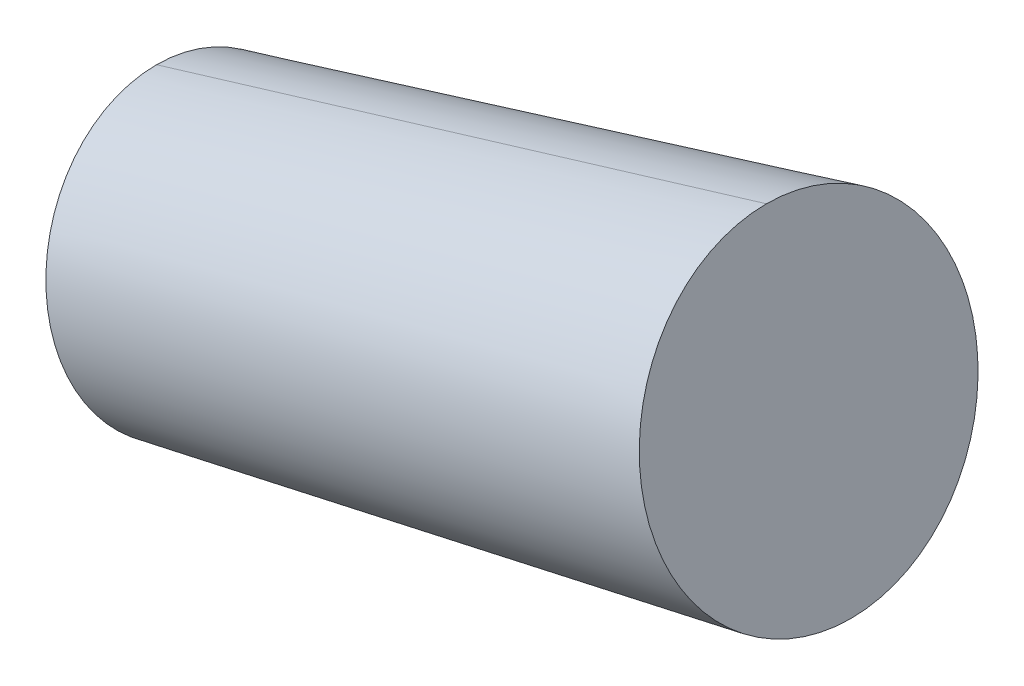
ISO-10303-21;
HEADER;
FILE_DESCRIPTION(('STEP AP214'),'2;1');
FILE_NAME('part.step','',(''),(''),'','','');
FILE_SCHEMA(('AUTOMOTIVE_DESIGN { 1 0 10303 214 1 1 1 1 }'));
ENDSEC;
DATA;
#1=APPLICATION_CONTEXT('core data for automotive mechanical design processes');
#2=APPLICATION_PROTOCOL_DEFINITION('international standard','automotive_design',2000,#1);
#3=PRODUCT_CONTEXT('',#1,'mechanical');
#4=PRODUCT('Part','Part','',(#3));
#5=PRODUCT_RELATED_PRODUCT_CATEGORY('part','',(#4));
#6=PRODUCT_DEFINITION_FORMATION('','',#4);
#7=PRODUCT_DEFINITION_CONTEXT('part definition',#1,'design');
#8=PRODUCT_DEFINITION('design','',#6,#7);
#9=PRODUCT_DEFINITION_SHAPE('','',#8);
#10=(LENGTH_UNIT() NAMED_UNIT(*) SI_UNIT(.MILLI.,.METRE.));
#11=(NAMED_UNIT(*) PLANE_ANGLE_UNIT() SI_UNIT($,.RADIAN.));
#12=(NAMED_UNIT(*) SI_UNIT($,.STERADIAN.) SOLID_ANGLE_UNIT());
#13=UNCERTAINTY_MEASURE_WITH_UNIT(LENGTH_MEASURE(1.E-05),#10,'distance_accuracy_value','');
#14=(GEOMETRIC_REPRESENTATION_CONTEXT(3) GLOBAL_UNCERTAINTY_ASSIGNED_CONTEXT((#13)) GLOBAL_UNIT_ASSIGNED_CONTEXT((#10,
#11,#12)) REPRESENTATION_CONTEXT('',''));
#15=CARTESIAN_POINT('',(0.,0.,0.));
#16=DIRECTION('',(0.,0.,1.));
#17=DIRECTION('',(1.,0.,0.));
#18=AXIS2_PLACEMENT_3D('',#15,#16,#17);
#19=CARTESIAN_POINT('',(13.7972443341172,26.173601392212,0.));
#20=DIRECTION('',(-0.966301990321941,-0.257411078821124,0.));
#21=DIRECTION('',(0.257411078821124,-0.966301990321941,0.));
#22=AXIS2_PLACEMENT_3D('',#19,#20,#21);
#23=PLANE('',#22);
#24=CARTESIAN_POINT('',(13.7972443341174,26.1736013922121,0.));
#25=DIRECTION('',(-0.966301990321941,-0.257411078821124,0.));
#26=DIRECTION('',(0.257411078821124,-0.966301990321941,0.));
#27=AXIS2_PLACEMENT_3D('',#24,#25,#26);
#28=CIRCLE('',#27,3.3725535602678);
#29=CARTESIAN_POINT('',(12.9291116837869,29.4325066099662,0.));
#30=VERTEX_POINT('',#29);
#31=CARTESIAN_POINT('',(14.665376984448,22.914696174458,0.));
#32=VERTEX_POINT('',#31);
#33=EDGE_CURVE('E11',#30,#32,#28,.T.);
#34=ORIENTED_EDGE('',*,*,#33,.F.);
#35=CARTESIAN_POINT('',(13.7972443341174,26.1736013922121,0.));
#36=DIRECTION('',(-0.966301990321941,-0.257411078821124,0.));
#37=DIRECTION('',(0.257411078821124,-0.966301990321941,0.));
#38=AXIS2_PLACEMENT_3D('',#35,#36,#37);
#39=CIRCLE('',#38,3.3725535602678);
#40=EDGE_CURVE('E25',#32,#30,#39,.T.);
#41=ORIENTED_EDGE('',*,*,#40,.F.);
#42=EDGE_LOOP('',(#34,#41));
#43=FACE_BOUND('',#42,.T.);
#44=ADVANCED_FACE('F17',(#43),#23,.F.);
#45=CARTESIAN_POINT('',(13.7972443341174,26.1736013922121,0.));
#46=DIRECTION('',(0.966301990321941,0.257411078821124,0.));
#47=DIRECTION('',(0.,0.,-1.));
#48=AXIS2_PLACEMENT_3D('',#45,#46,#47);
#49=CONICAL_SURFACE('',#48,3.37255356026779,0.0334492351144787);
#50=DIRECTION('',(0.974370064785235,0.224951054343868,0.));
#51=VECTOR('',#50,1.);
#52=CARTESIAN_POINT('',(1.90117016748439,19.967846835473,0.));
#53=LINE('',#52,#51);
#54=CARTESIAN_POINT('',(1.9011701674844,19.967846835473,0.));
#55=VERTEX_POINT('',#54);
#56=EDGE_CURVE('E43',#55,#32,#53,.T.);
#57=ORIENTED_EDGE('',*,*,#56,.T.);
#58=ORIENTED_EDGE('',*,*,#40,.T.);
#59=DIRECTION('',(0.957152868391764,0.289583125422422,0.));
#60=VECTOR('',#59,1.);
#61=CARTESIAN_POINT('',(0.390449414543943,25.638979861575,0.));
#62=LINE('',#61,#60);
#63=CARTESIAN_POINT('',(0.390449414543943,25.638979861575,0.));
#64=VERTEX_POINT('',#63);
#65=EDGE_CURVE('E45',#64,#30,#62,.T.);
#66=ORIENTED_EDGE('',*,*,#65,.F.);
#67=CARTESIAN_POINT('',(1.14580979101417,22.803413348524,0.));
#68=DIRECTION('',(-0.966301990321941,-0.257411078821124,0.));
#69=DIRECTION('',(0.257411078821124,-0.966301990321941,0.));
#70=AXIS2_PLACEMENT_3D('',#67,#68,#69);
#71=CIRCLE('',#70,2.93445169465735);
#72=EDGE_CURVE('E40',#55,#64,#71,.T.);
#73=ORIENTED_EDGE('',*,*,#72,.F.);
#74=EDGE_LOOP('',(#57,#58,#66,#73));
#75=FACE_BOUND('',#74,.T.);
#76=ADVANCED_FACE('F42',(#75),#49,.T.);
#77=CARTESIAN_POINT('',(1.90117016748441,19.967846835473,0.));
#78=DIRECTION('',(0.966301990321941,0.257411078821124,0.));
#79=DIRECTION('',(-0.257411078821124,0.966301990321941,0.));
#80=AXIS2_PLACEMENT_3D('',#77,#78,#79);
#81=PLANE('',#80);
#82=ORIENTED_EDGE('',*,*,#72,.T.);
#83=CARTESIAN_POINT('',(1.14580979101417,22.803413348524,0.));
#84=DIRECTION('',(-0.966301990321941,-0.257411078821124,0.));
#85=DIRECTION('',(0.257411078821124,-0.966301990321941,0.));
#86=AXIS2_PLACEMENT_3D('',#83,#84,#85);
#87=CIRCLE('',#86,2.93445169465735);
#88=EDGE_CURVE('E49',#64,#55,#87,.T.);
#89=ORIENTED_EDGE('',*,*,#88,.T.);
#90=EDGE_LOOP('',(#82,#89));
#91=FACE_BOUND('',#90,.T.);
#92=ADVANCED_FACE('F54',(#91),#81,.F.);
#93=CARTESIAN_POINT('',(13.7972443341174,26.1736013922121,0.));
#94=DIRECTION('',(0.966301990321941,0.257411078821124,0.));
#95=DIRECTION('',(0.,0.,1.));
#96=AXIS2_PLACEMENT_3D('',#93,#94,#95);
#97=CONICAL_SURFACE('',#96,3.37255356026779,0.0334492351144787);
#98=ORIENTED_EDGE('',*,*,#56,.F.);
#99=ORIENTED_EDGE('',*,*,#88,.F.);
#100=ORIENTED_EDGE('',*,*,#65,.T.);
#101=ORIENTED_EDGE('',*,*,#33,.T.);
#102=EDGE_LOOP('',(#98,#99,#100,#101));
#103=FACE_BOUND('',#102,.T.);
#104=ADVANCED_FACE('F52',(#103),#97,.T.);
#105=CLOSED_SHELL('',(#44,#76,#92,#104));
#106=MANIFOLD_SOLID_BREP('B1',#105);
#107=ADVANCED_BREP_SHAPE_REPRESENTATION('',(#18,#106),#14);
#108=SHAPE_DEFINITION_REPRESENTATION(#9,#107);
ENDSEC;
END-ISO-10303-21;
